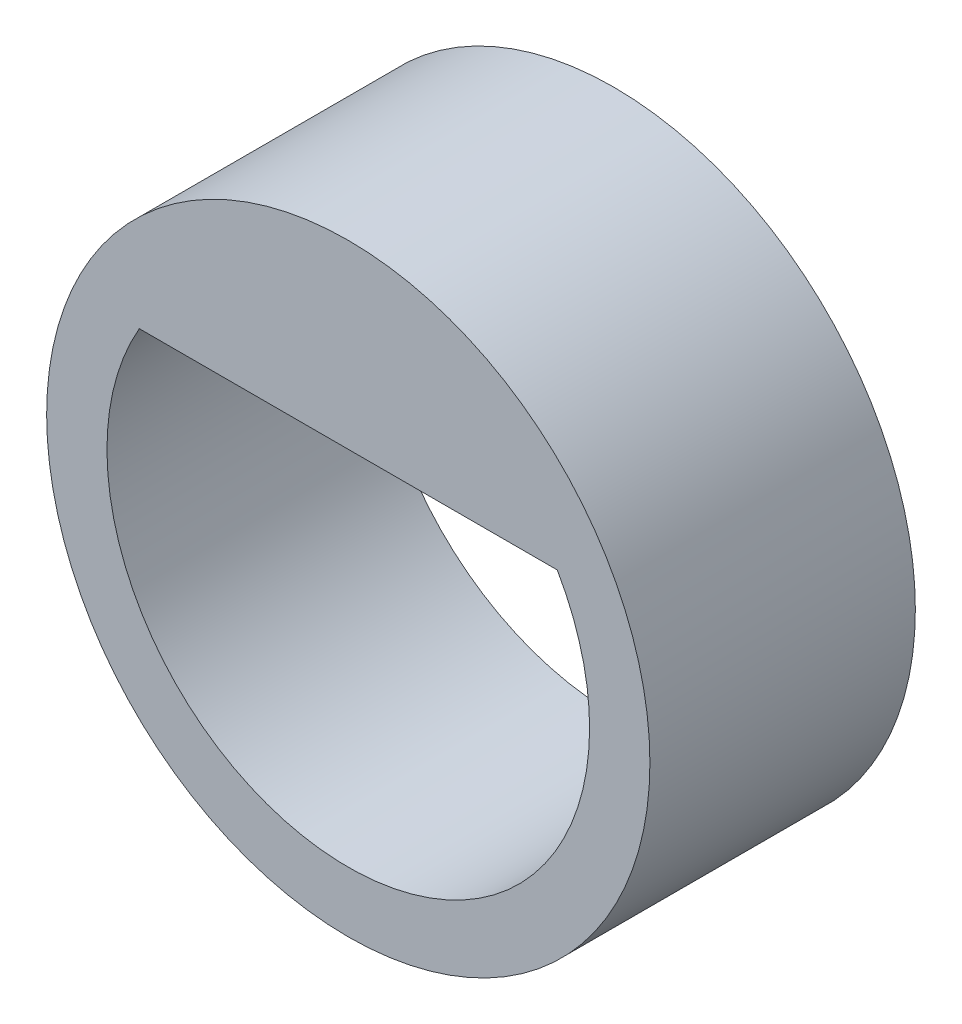
ISO-10303-21;
HEADER;
FILE_DESCRIPTION(('STEP AP214'),'2;1');
FILE_NAME('part.step','',(''),(''),'','','');
FILE_SCHEMA(('AUTOMOTIVE_DESIGN { 1 0 10303 214 1 1 1 1 }'));
ENDSEC;
DATA;
#1=APPLICATION_CONTEXT('core data for automotive mechanical design processes');
#2=APPLICATION_PROTOCOL_DEFINITION('international standard','automotive_design',2000,#1);
#3=PRODUCT_CONTEXT('',#1,'mechanical');
#4=PRODUCT('Part','Part','',(#3));
#5=PRODUCT_RELATED_PRODUCT_CATEGORY('part','',(#4));
#6=PRODUCT_DEFINITION_FORMATION('','',#4);
#7=PRODUCT_DEFINITION_CONTEXT('part definition',#1,'design');
#8=PRODUCT_DEFINITION('design','',#6,#7);
#9=PRODUCT_DEFINITION_SHAPE('','',#8);
#10=(LENGTH_UNIT() NAMED_UNIT(*) SI_UNIT(.MILLI.,.METRE.));
#11=(NAMED_UNIT(*) PLANE_ANGLE_UNIT() SI_UNIT($,.RADIAN.));
#12=(NAMED_UNIT(*) SI_UNIT($,.STERADIAN.) SOLID_ANGLE_UNIT());
#13=UNCERTAINTY_MEASURE_WITH_UNIT(LENGTH_MEASURE(1.E-05),#10,'distance_accuracy_value','');
#14=(GEOMETRIC_REPRESENTATION_CONTEXT(3) GLOBAL_UNCERTAINTY_ASSIGNED_CONTEXT((#13)) GLOBAL_UNIT_ASSIGNED_CONTEXT((#10,
#11,#12)) REPRESENTATION_CONTEXT('',''));
#15=CARTESIAN_POINT('',(0.,0.,0.));
#16=DIRECTION('',(0.,0.,1.));
#17=DIRECTION('',(1.,0.,0.));
#18=AXIS2_PLACEMENT_3D('',#15,#16,#17);
#19=CARTESIAN_POINT('',(0.,0.,2.2));
#20=DIRECTION('',(0.,0.,1.));
#21=DIRECTION('',(1.,0.,0.));
#22=AXIS2_PLACEMENT_3D('',#19,#20,#21);
#23=PLANE('',#22);
#24=CARTESIAN_POINT('',(0.,0.,2.2));
#25=DIRECTION('',(0.,0.,1.));
#26=DIRECTION('',(1.,0.,0.));
#27=AXIS2_PLACEMENT_3D('',#24,#25,#26);
#28=CIRCLE('',#27,2.5);
#29=CARTESIAN_POINT('',(2.5,0.,2.2));
#30=VERTEX_POINT('',#29);
#31=EDGE_CURVE('E11',#30,#30,#28,.T.);
#32=ORIENTED_EDGE('',*,*,#31,.T.);
#33=EDGE_LOOP('',(#32));
#34=FACE_BOUND('',#33,.T.);
#35=DIRECTION('',(-1.,0.,0.));
#36=VECTOR('',#35,1.);
#37=CARTESIAN_POINT('',(-1.73205080756888,1.,2.2));
#38=LINE('',#37,#36);
#39=CARTESIAN_POINT('',(1.73205080756888,1.,2.2));
#40=VERTEX_POINT('',#39);
#41=CARTESIAN_POINT('',(-1.73205080756888,1.,2.2));
#42=VERTEX_POINT('',#41);
#43=EDGE_CURVE('E73',#40,#42,#38,.T.);
#44=ORIENTED_EDGE('',*,*,#43,.F.);
#45=CARTESIAN_POINT('',(0.,0.,2.2));
#46=DIRECTION('',(0.,0.,1.));
#47=DIRECTION('',(1.,0.,0.));
#48=AXIS2_PLACEMENT_3D('',#45,#46,#47);
#49=CIRCLE('',#48,2.);
#50=EDGE_CURVE('E64',#42,#40,#49,.T.);
#51=ORIENTED_EDGE('',*,*,#50,.F.);
#52=EDGE_LOOP('',(#44,#51));
#53=FACE_BOUND('',#52,.T.);
#54=ADVANCED_FACE('F32',(#34,#53),#23,.T.);
#55=CARTESIAN_POINT('',(0.,0.,0.));
#56=DIRECTION('',(0.,0.,1.));
#57=DIRECTION('',(1.,0.,0.));
#58=AXIS2_PLACEMENT_3D('',#55,#56,#57);
#59=PLANE('',#58);
#60=CARTESIAN_POINT('',(0.,0.,0.));
#61=DIRECTION('',(0.,0.,1.));
#62=DIRECTION('',(1.,0.,0.));
#63=AXIS2_PLACEMENT_3D('',#60,#61,#62);
#64=CIRCLE('',#63,2.5);
#65=CARTESIAN_POINT('',(2.5,0.,0.));
#66=VERTEX_POINT('',#65);
#67=EDGE_CURVE('E36',#66,#66,#64,.T.);
#68=ORIENTED_EDGE('',*,*,#67,.F.);
#69=EDGE_LOOP('',(#68));
#70=FACE_BOUND('',#69,.T.);
#71=CARTESIAN_POINT('',(0.,0.,0.));
#72=DIRECTION('',(0.,0.,1.));
#73=DIRECTION('',(1.,0.,0.));
#74=AXIS2_PLACEMENT_3D('',#71,#72,#73);
#75=CIRCLE('',#74,2.);
#76=CARTESIAN_POINT('',(-1.73205080756888,1.,0.));
#77=VERTEX_POINT('',#76);
#78=CARTESIAN_POINT('',(1.73205080756888,1.,0.));
#79=VERTEX_POINT('',#78);
#80=EDGE_CURVE('E54',#77,#79,#75,.T.);
#81=ORIENTED_EDGE('',*,*,#80,.T.);
#82=DIRECTION('',(-1.,0.,0.));
#83=VECTOR('',#82,1.);
#84=CARTESIAN_POINT('',(-1.73205080756888,1.,0.));
#85=LINE('',#84,#83);
#86=EDGE_CURVE('E60',#79,#77,#85,.T.);
#87=ORIENTED_EDGE('',*,*,#86,.T.);
#88=EDGE_LOOP('',(#81,#87));
#89=FACE_BOUND('',#88,.T.);
#90=ADVANCED_FACE('F70',(#70,#89),#59,.F.);
#91=CARTESIAN_POINT('',(0.,0.,2.2));
#92=DIRECTION('',(0.,0.,-1.));
#93=DIRECTION('',(-1.,0.,0.));
#94=AXIS2_PLACEMENT_3D('',#91,#92,#93);
#95=CYLINDRICAL_SURFACE('',#94,2.5);
#96=ORIENTED_EDGE('',*,*,#31,.F.);
#97=EDGE_LOOP('',(#96));
#98=FACE_BOUND('',#97,.T.);
#99=ORIENTED_EDGE('',*,*,#67,.T.);
#100=EDGE_LOOP('',(#99));
#101=FACE_BOUND('',#100,.T.);
#102=ADVANCED_FACE('F34',(#98,#101),#95,.T.);
#103=CARTESIAN_POINT('',(0.,0.,2.2));
#104=DIRECTION('',(0.,0.,-1.));
#105=DIRECTION('',(-1.,0.,0.));
#106=AXIS2_PLACEMENT_3D('',#103,#104,#105);
#107=CYLINDRICAL_SURFACE('',#106,2.);
#108=ORIENTED_EDGE('',*,*,#80,.F.);
#109=DIRECTION('',(0.,0.,-1.));
#110=VECTOR('',#109,1.);
#111=CARTESIAN_POINT('',(-1.73205080756888,1.,2.2));
#112=LINE('',#111,#110);
#113=EDGE_CURVE('E62',#42,#77,#112,.T.);
#114=ORIENTED_EDGE('',*,*,#113,.F.);
#115=ORIENTED_EDGE('',*,*,#50,.T.);
#116=DIRECTION('',(0.,0.,-1.));
#117=VECTOR('',#116,1.);
#118=CARTESIAN_POINT('',(1.73205080756888,1.,2.2));
#119=LINE('',#118,#117);
#120=EDGE_CURVE('E47',#40,#79,#119,.T.);
#121=ORIENTED_EDGE('',*,*,#120,.T.);
#122=EDGE_LOOP('',(#108,#114,#115,#121));
#123=FACE_BOUND('',#122,.T.);
#124=ADVANCED_FACE('F66',(#123),#107,.F.);
#125=CARTESIAN_POINT('',(-1.73205080756888,1.,2.2));
#126=DIRECTION('',(0.,-1.,0.));
#127=DIRECTION('',(0.,0.,-1.));
#128=AXIS2_PLACEMENT_3D('',#125,#126,#127);
#129=PLANE('',#128);
#130=ORIENTED_EDGE('',*,*,#86,.F.);
#131=ORIENTED_EDGE('',*,*,#120,.F.);
#132=ORIENTED_EDGE('',*,*,#43,.T.);
#133=ORIENTED_EDGE('',*,*,#113,.T.);
#134=EDGE_LOOP('',(#130,#131,#132,#133));
#135=FACE_BOUND('',#134,.T.);
#136=ADVANCED_FACE('F61',(#135),#129,.T.);
#137=CLOSED_SHELL('',(#54,#90,#102,#124,#136));
#138=MANIFOLD_SOLID_BREP('B2',#137);
#139=ADVANCED_BREP_SHAPE_REPRESENTATION('',(#18,#138),#14);
#140=SHAPE_DEFINITION_REPRESENTATION(#9,#139);
ENDSEC;
END-ISO-10303-21;
